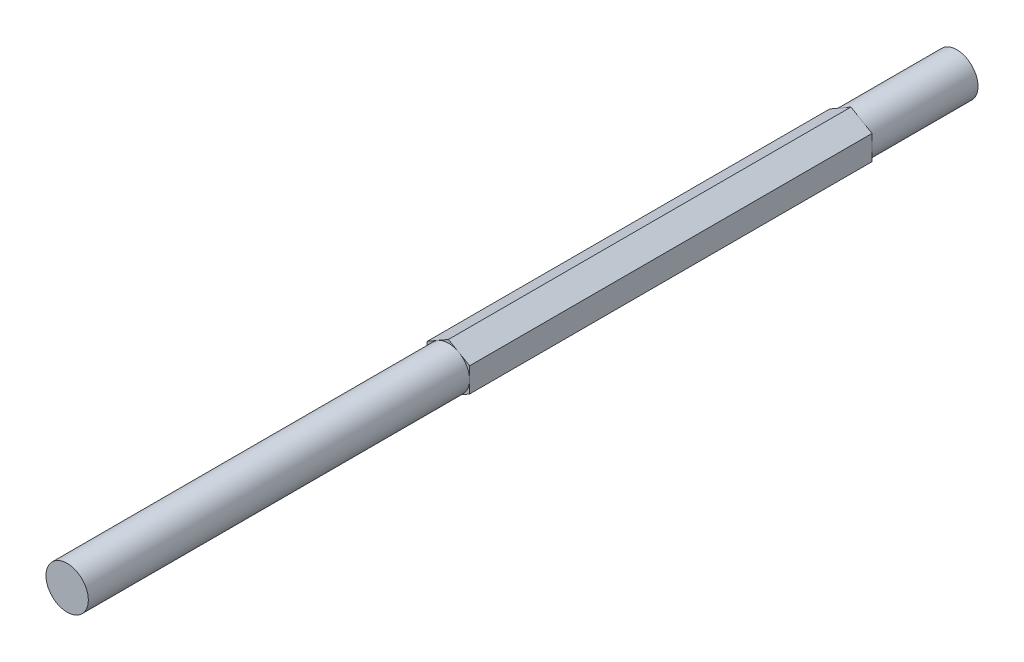
ISO-10303-21;
HEADER;
FILE_DESCRIPTION(('STEP AP214'),'2;1');
FILE_NAME('part.step','',(''),(''),'','','');
FILE_SCHEMA(('AUTOMOTIVE_DESIGN { 1 0 10303 214 1 1 1 1 }'));
ENDSEC;
DATA;
#1=APPLICATION_CONTEXT('core data for automotive mechanical design processes');
#2=APPLICATION_PROTOCOL_DEFINITION('international standard','automotive_design',2000,#1);
#3=PRODUCT_CONTEXT('',#1,'mechanical');
#4=PRODUCT('Part','Part','',(#3));
#5=PRODUCT_RELATED_PRODUCT_CATEGORY('part','',(#4));
#6=PRODUCT_DEFINITION_FORMATION('','',#4);
#7=PRODUCT_DEFINITION_CONTEXT('part definition',#1,'design');
#8=PRODUCT_DEFINITION('design','',#6,#7);
#9=PRODUCT_DEFINITION_SHAPE('','',#8);
#10=(LENGTH_UNIT() NAMED_UNIT(*) SI_UNIT(.MILLI.,.METRE.));
#11=(NAMED_UNIT(*) PLANE_ANGLE_UNIT() SI_UNIT($,.RADIAN.));
#12=(NAMED_UNIT(*) SI_UNIT($,.STERADIAN.) SOLID_ANGLE_UNIT());
#13=UNCERTAINTY_MEASURE_WITH_UNIT(LENGTH_MEASURE(1.E-05),#10,'distance_accuracy_value','');
#14=(GEOMETRIC_REPRESENTATION_CONTEXT(3) GLOBAL_UNCERTAINTY_ASSIGNED_CONTEXT((#13)) GLOBAL_UNIT_ASSIGNED_CONTEXT((#10,
#11,#12)) REPRESENTATION_CONTEXT('',''));
#15=CARTESIAN_POINT('',(0.,0.,0.));
#16=DIRECTION('',(0.,0.,1.));
#17=DIRECTION('',(1.,0.,0.));
#18=AXIS2_PLACEMENT_3D('',#15,#16,#17);
#19=CARTESIAN_POINT('',(3.17499999999998,1.83308710467707,133.35));
#20=DIRECTION('',(-0.5,-0.866025403784439,0.));
#21=DIRECTION('',(0.866025403784439,-0.5,0.));
#22=AXIS2_PLACEMENT_3D('',#19,#20,#21);
#23=PLANE('',#22);
#24=DIRECTION('',(0.866025403784439,-0.5,0.));
#25=VECTOR('',#24,1.);
#26=CARTESIAN_POINT('',(3.17499999999998,1.83308710467707,15.875));
#27=LINE('',#26,#25);
#28=CARTESIAN_POINT('',(0.,3.66617420935412,15.875));
#29=VERTEX_POINT('',#28);
#30=CARTESIAN_POINT('',(1.5875,2.74963065701559,15.875));
#31=VERTEX_POINT('',#30);
#32=EDGE_CURVE('E265',#29,#31,#27,.T.);
#33=ORIENTED_EDGE('',*,*,#32,.F.);
#34=DIRECTION('',(0.,0.,-1.));
#35=VECTOR('',#34,1.);
#36=CARTESIAN_POINT('',(0.,3.66617420935412,133.35));
#37=LINE('',#36,#35);
#38=CARTESIAN_POINT('',(0.,3.66617420935412,76.2));
#39=VERTEX_POINT('',#38);
#40=EDGE_CURVE('E192',#39,#29,#37,.T.);
#41=ORIENTED_EDGE('',*,*,#40,.F.);
#42=DIRECTION('',(-0.866025403784439,0.5,0.));
#43=VECTOR('',#42,1.);
#44=CARTESIAN_POINT('',(3.17499999999998,1.83308710467707,76.2));
#45=LINE('',#44,#43);
#46=CARTESIAN_POINT('',(1.58749999999999,2.74963065701558,76.2));
#47=VERTEX_POINT('',#46);
#48=EDGE_CURVE('E177',#47,#39,#45,.T.);
#49=ORIENTED_EDGE('',*,*,#48,.F.);
#50=CARTESIAN_POINT('',(3.17499999999998,1.83308710467707,76.2));
#51=VERTEX_POINT('',#50);
#52=EDGE_CURVE('E179',#51,#47,#45,.T.);
#53=ORIENTED_EDGE('',*,*,#52,.F.);
#54=DIRECTION('',(0.,0.,-1.));
#55=VECTOR('',#54,1.);
#56=CARTESIAN_POINT('',(3.17499999999998,1.83308710467707,133.35));
#57=LINE('',#56,#55);
#58=CARTESIAN_POINT('',(3.17499999999998,1.83308710467707,15.875));
#59=VERTEX_POINT('',#58);
#60=EDGE_CURVE('E180',#51,#59,#57,.T.);
#61=ORIENTED_EDGE('',*,*,#60,.T.);
#62=EDGE_CURVE('E264',#31,#59,#27,.T.);
#63=ORIENTED_EDGE('',*,*,#62,.F.);
#64=EDGE_LOOP('',(#33,#41,#49,#53,#61,#63));
#65=FACE_BOUND('',#64,.T.);
#66=ADVANCED_FACE('F34',(#65),#23,.F.);
#67=CARTESIAN_POINT('',(0.,3.66617420935412,133.35));
#68=DIRECTION('',(0.499999999999999,-0.866025403784439,0.));
#69=DIRECTION('',(0.866025403784439,0.499999999999999,0.));
#70=AXIS2_PLACEMENT_3D('',#67,#68,#69);
#71=PLANE('',#70);
#72=DIRECTION('',(0.866025403784439,0.499999999999999,0.));
#73=VECTOR('',#72,1.);
#74=CARTESIAN_POINT('',(0.,3.66617420935412,15.875));
#75=LINE('',#74,#73);
#76=CARTESIAN_POINT('',(-3.17500000000001,1.83308710467706,15.875));
#77=VERTEX_POINT('',#76);
#78=CARTESIAN_POINT('',(-1.5875,2.74963065701559,15.875));
#79=VERTEX_POINT('',#78);
#80=EDGE_CURVE('E149',#77,#79,#75,.T.);
#81=ORIENTED_EDGE('',*,*,#80,.F.);
#82=DIRECTION('',(0.,0.,-1.));
#83=VECTOR('',#82,1.);
#84=CARTESIAN_POINT('',(-3.17500000000001,1.83308710467706,133.35));
#85=LINE('',#84,#83);
#86=CARTESIAN_POINT('',(-3.17500000000001,1.83308710467706,76.2));
#87=VERTEX_POINT('',#86);
#88=EDGE_CURVE('E157',#87,#77,#85,.T.);
#89=ORIENTED_EDGE('',*,*,#88,.F.);
#90=DIRECTION('',(-0.866025403784439,-0.499999999999999,0.));
#91=VECTOR('',#90,1.);
#92=CARTESIAN_POINT('',(0.,3.66617420935412,76.2));
#93=LINE('',#92,#91);
#94=CARTESIAN_POINT('',(-1.58749999999999,2.74963065701558,76.2));
#95=VERTEX_POINT('',#94);
#96=EDGE_CURVE('E174',#95,#87,#93,.T.);
#97=ORIENTED_EDGE('',*,*,#96,.F.);
#98=EDGE_CURVE('E176',#39,#95,#93,.T.);
#99=ORIENTED_EDGE('',*,*,#98,.F.);
#100=ORIENTED_EDGE('',*,*,#40,.T.);
#101=EDGE_CURVE('E162',#79,#29,#75,.T.);
#102=ORIENTED_EDGE('',*,*,#101,.F.);
#103=EDGE_LOOP('',(#81,#89,#97,#99,#100,#102));
#104=FACE_BOUND('',#103,.T.);
#105=ADVANCED_FACE('F232',(#104),#71,.F.);
#106=CARTESIAN_POINT('',(-3.17500000000001,1.83308710467706,133.35));
#107=DIRECTION('',(1.,0.,0.));
#108=DIRECTION('',(0.,0.,-1.));
#109=AXIS2_PLACEMENT_3D('',#106,#107,#108);
#110=PLANE('',#109);
#111=DIRECTION('',(0.,1.,0.));
#112=VECTOR('',#111,1.);
#113=CARTESIAN_POINT('',(-3.17500000000001,1.83308710467706,15.875));
#114=LINE('',#113,#112);
#115=CARTESIAN_POINT('',(-3.17500000000001,-1.83308710467706,15.875));
#116=VERTEX_POINT('',#115);
#117=CARTESIAN_POINT('',(-3.175,0.,15.875));
#118=VERTEX_POINT('',#117);
#119=EDGE_CURVE('E124',#116,#118,#114,.T.);
#120=ORIENTED_EDGE('',*,*,#119,.F.);
#121=DIRECTION('',(0.,0.,-1.));
#122=VECTOR('',#121,1.);
#123=CARTESIAN_POINT('',(-3.17500000000001,-1.83308710467706,133.35));
#124=LINE('',#123,#122);
#125=CARTESIAN_POINT('',(-3.17500000000001,-1.83308710467706,76.2));
#126=VERTEX_POINT('',#125);
#127=EDGE_CURVE('E189',#126,#116,#124,.T.);
#128=ORIENTED_EDGE('',*,*,#127,.F.);
#129=DIRECTION('',(0.,-1.,0.));
#130=VECTOR('',#129,1.);
#131=CARTESIAN_POINT('',(-3.17500000000001,1.83308710467706,76.2));
#132=LINE('',#131,#130);
#133=CARTESIAN_POINT('',(-3.17499999999998,0.,76.2));
#134=VERTEX_POINT('',#133);
#135=EDGE_CURVE('E171',#134,#126,#132,.T.);
#136=ORIENTED_EDGE('',*,*,#135,.F.);
#137=EDGE_CURVE('E173',#87,#134,#132,.T.);
#138=ORIENTED_EDGE('',*,*,#137,.F.);
#139=ORIENTED_EDGE('',*,*,#88,.T.);
#140=EDGE_CURVE('E136',#118,#77,#114,.T.);
#141=ORIENTED_EDGE('',*,*,#140,.F.);
#142=EDGE_LOOP('',(#120,#128,#136,#138,#139,#141));
#143=FACE_BOUND('',#142,.T.);
#144=ADVANCED_FACE('F154',(#143),#110,.F.);
#145=CARTESIAN_POINT('',(-3.17500000000001,-1.83308710467706,133.35));
#146=DIRECTION('',(0.500000000000001,0.866025403784438,0.));
#147=DIRECTION('',(-0.866025403784438,0.500000000000001,0.));
#148=AXIS2_PLACEMENT_3D('',#145,#146,#147);
#149=PLANE('',#148);
#150=DIRECTION('',(-0.866025403784438,0.500000000000001,0.));
#151=VECTOR('',#150,1.);
#152=CARTESIAN_POINT('',(-3.17500000000001,-1.83308710467706,15.875));
#153=LINE('',#152,#151);
#154=CARTESIAN_POINT('',(0.,-3.66617420935412,15.875));
#155=VERTEX_POINT('',#154);
#156=CARTESIAN_POINT('',(-1.5875,-2.74963065701559,15.875));
#157=VERTEX_POINT('',#156);
#158=EDGE_CURVE('E159',#155,#157,#153,.T.);
#159=ORIENTED_EDGE('',*,*,#158,.F.);
#160=DIRECTION('',(0.,0.,-1.));
#161=VECTOR('',#160,1.);
#162=CARTESIAN_POINT('',(0.,-3.66617420935412,133.35));
#163=LINE('',#162,#161);
#164=CARTESIAN_POINT('',(0.,-3.66617420935412,76.2));
#165=VERTEX_POINT('',#164);
#166=EDGE_CURVE('E186',#165,#155,#163,.T.);
#167=ORIENTED_EDGE('',*,*,#166,.F.);
#168=DIRECTION('',(0.866025403784438,-0.500000000000001,0.));
#169=VECTOR('',#168,1.);
#170=CARTESIAN_POINT('',(-3.17500000000001,-1.83308710467706,76.2));
#171=LINE('',#170,#169);
#172=CARTESIAN_POINT('',(-1.58749999999999,-2.74963065701558,76.2));
#173=VERTEX_POINT('',#172);
#174=EDGE_CURVE('E168',#173,#165,#171,.T.);
#175=ORIENTED_EDGE('',*,*,#174,.F.);
#176=EDGE_CURVE('E170',#126,#173,#171,.T.);
#177=ORIENTED_EDGE('',*,*,#176,.F.);
#178=ORIENTED_EDGE('',*,*,#127,.T.);
#179=EDGE_CURVE('E130',#157,#116,#153,.T.);
#180=ORIENTED_EDGE('',*,*,#179,.F.);
#181=EDGE_LOOP('',(#159,#167,#175,#177,#178,#180));
#182=FACE_BOUND('',#181,.T.);
#183=ADVANCED_FACE('F248',(#182),#149,.F.);
#184=CARTESIAN_POINT('',(0.,-3.66617420935412,133.35));
#185=DIRECTION('',(-0.5,0.866025403784439,0.));
#186=DIRECTION('',(-0.866025403784439,-0.5,0.));
#187=AXIS2_PLACEMENT_3D('',#184,#185,#186);
#188=PLANE('',#187);
#189=DIRECTION('',(-0.866025403784439,-0.5,0.));
#190=VECTOR('',#189,1.);
#191=CARTESIAN_POINT('',(0.,-3.66617420935412,15.875));
#192=LINE('',#191,#190);
#193=CARTESIAN_POINT('',(3.17499999999998,-1.83308710467706,15.875));
#194=VERTEX_POINT('',#193);
#195=CARTESIAN_POINT('',(1.5875,-2.74963065701559,15.875));
#196=VERTEX_POINT('',#195);
#197=EDGE_CURVE('E151',#194,#196,#192,.T.);
#198=ORIENTED_EDGE('',*,*,#197,.F.);
#199=DIRECTION('',(0.,0.,-1.));
#200=VECTOR('',#199,1.);
#201=CARTESIAN_POINT('',(3.17499999999998,-1.83308710467706,133.35));
#202=LINE('',#201,#200);
#203=CARTESIAN_POINT('',(3.17499999999998,-1.83308710467706,76.2));
#204=VERTEX_POINT('',#203);
#205=EDGE_CURVE('E183',#204,#194,#202,.T.);
#206=ORIENTED_EDGE('',*,*,#205,.F.);
#207=DIRECTION('',(0.866025403784439,0.5,0.));
#208=VECTOR('',#207,1.);
#209=CARTESIAN_POINT('',(0.,-3.66617420935412,76.2));
#210=LINE('',#209,#208);
#211=CARTESIAN_POINT('',(1.58749999999999,-2.74963065701558,76.2));
#212=VERTEX_POINT('',#211);
#213=EDGE_CURVE('E164',#212,#204,#210,.T.);
#214=ORIENTED_EDGE('',*,*,#213,.F.);
#215=EDGE_CURVE('E167',#165,#212,#210,.T.);
#216=ORIENTED_EDGE('',*,*,#215,.F.);
#217=ORIENTED_EDGE('',*,*,#166,.T.);
#218=EDGE_CURVE('E267',#196,#155,#192,.T.);
#219=ORIENTED_EDGE('',*,*,#218,.F.);
#220=EDGE_LOOP('',(#198,#206,#214,#216,#217,#219));
#221=FACE_BOUND('',#220,.T.);
#222=ADVANCED_FACE('F256',(#221),#188,.F.);
#223=CARTESIAN_POINT('',(3.17499999999998,-1.83308710467706,133.35));
#224=DIRECTION('',(-1.,0.,0.));
#225=DIRECTION('',(0.,0.,1.));
#226=AXIS2_PLACEMENT_3D('',#223,#224,#225);
#227=PLANE('',#226);
#228=DIRECTION('',(0.,-1.,0.));
#229=VECTOR('',#228,1.);
#230=CARTESIAN_POINT('',(3.17499999999998,-1.83308710467706,15.875));
#231=LINE('',#230,#229);
#232=CARTESIAN_POINT('',(3.17499999999999,0.,15.875));
#233=VERTEX_POINT('',#232);
#234=EDGE_CURVE('E12',#59,#233,#231,.T.);
#235=ORIENTED_EDGE('',*,*,#234,.F.);
#236=ORIENTED_EDGE('',*,*,#60,.F.);
#237=DIRECTION('',(0.,1.,0.));
#238=VECTOR('',#237,1.);
#239=CARTESIAN_POINT('',(3.17499999999998,-1.83308710467706,76.2));
#240=LINE('',#239,#238);
#241=CARTESIAN_POINT('',(3.17499999999998,0.,76.2));
#242=VERTEX_POINT('',#241);
#243=EDGE_CURVE('E198',#242,#51,#240,.T.);
#244=ORIENTED_EDGE('',*,*,#243,.F.);
#245=EDGE_CURVE('E199',#204,#242,#240,.T.);
#246=ORIENTED_EDGE('',*,*,#245,.F.);
#247=ORIENTED_EDGE('',*,*,#205,.T.);
#248=EDGE_CURVE('E37',#233,#194,#231,.T.);
#249=ORIENTED_EDGE('',*,*,#248,.F.);
#250=EDGE_LOOP('',(#235,#236,#244,#246,#247,#249));
#251=FACE_BOUND('',#250,.T.);
#252=ADVANCED_FACE('F216',(#251),#227,.F.);
#253=CARTESIAN_POINT('',(0.,0.,76.2));
#254=DIRECTION('',(0.,0.,1.));
#255=DIRECTION('',(1.,0.,0.));
#256=AXIS2_PLACEMENT_3D('',#253,#254,#255);
#257=PLANE('',#256);
#258=ORIENTED_EDGE('',*,*,#52,.T.);
#259=CARTESIAN_POINT('',(0.,0.,76.2));
#260=DIRECTION('',(0.,0.,1.));
#261=DIRECTION('',(1.,0.,0.));
#262=AXIS2_PLACEMENT_3D('',#259,#260,#261);
#263=CIRCLE('',#262,3.17499999999998);
#264=EDGE_CURVE('E56',#242,#47,#263,.T.);
#265=ORIENTED_EDGE('',*,*,#264,.F.);
#266=ORIENTED_EDGE('',*,*,#243,.T.);
#267=EDGE_LOOP('',(#258,#265,#266));
#268=FACE_BOUND('',#267,.T.);
#269=ADVANCED_FACE('F218',(#268),#257,.T.);
#270=ORIENTED_EDGE('',*,*,#48,.T.);
#271=ORIENTED_EDGE('',*,*,#98,.T.);
#272=EDGE_CURVE('E165',#47,#95,#263,.T.);
#273=ORIENTED_EDGE('',*,*,#272,.F.);
#274=EDGE_LOOP('',(#270,#271,#273));
#275=FACE_BOUND('',#274,.T.);
#276=ADVANCED_FACE('F227',(#275),#257,.T.);
#277=ORIENTED_EDGE('',*,*,#96,.T.);
#278=ORIENTED_EDGE('',*,*,#137,.T.);
#279=EDGE_CURVE('E237',#95,#134,#263,.T.);
#280=ORIENTED_EDGE('',*,*,#279,.F.);
#281=EDGE_LOOP('',(#277,#278,#280));
#282=FACE_BOUND('',#281,.T.);
#283=ADVANCED_FACE('F234',(#282),#257,.T.);
#284=ORIENTED_EDGE('',*,*,#135,.T.);
#285=ORIENTED_EDGE('',*,*,#176,.T.);
#286=EDGE_CURVE('E244',#134,#173,#263,.T.);
#287=ORIENTED_EDGE('',*,*,#286,.F.);
#288=EDGE_LOOP('',(#284,#285,#287));
#289=FACE_BOUND('',#288,.T.);
#290=ADVANCED_FACE('F241',(#289),#257,.T.);
#291=ORIENTED_EDGE('',*,*,#174,.T.);
#292=ORIENTED_EDGE('',*,*,#215,.T.);
#293=EDGE_CURVE('E253',#173,#212,#263,.T.);
#294=ORIENTED_EDGE('',*,*,#293,.F.);
#295=EDGE_LOOP('',(#291,#292,#294));
#296=FACE_BOUND('',#295,.T.);
#297=ADVANCED_FACE('F252',(#296),#257,.T.);
#298=ORIENTED_EDGE('',*,*,#213,.T.);
#299=ORIENTED_EDGE('',*,*,#245,.T.);
#300=EDGE_CURVE('E135',#212,#242,#263,.T.);
#301=ORIENTED_EDGE('',*,*,#300,.F.);
#302=EDGE_LOOP('',(#298,#299,#301));
#303=FACE_BOUND('',#302,.T.);
#304=ADVANCED_FACE('F209',(#303),#257,.T.);
#305=CARTESIAN_POINT('',(0.,0.,76.2));
#306=DIRECTION('',(0.,0.,1.));
#307=DIRECTION('',(1.,0.,0.));
#308=AXIS2_PLACEMENT_3D('',#305,#306,#307);
#309=CYLINDRICAL_SURFACE('',#308,3.17499999999998);
#310=CARTESIAN_POINT('',(0.,0.,133.35));
#311=DIRECTION('',(0.,0.,1.));
#312=DIRECTION('',(1.,0.,0.));
#313=AXIS2_PLACEMENT_3D('',#310,#311,#312);
#314=CIRCLE('',#313,3.17499999999998);
#315=CARTESIAN_POINT('',(3.17499999999998,0.,133.35));
#316=VERTEX_POINT('',#315);
#317=EDGE_CURVE('E195',#316,#316,#314,.T.);
#318=ORIENTED_EDGE('',*,*,#317,.F.);
#319=EDGE_LOOP('',(#318));
#320=FACE_BOUND('',#319,.T.);
#321=ORIENTED_EDGE('',*,*,#264,.T.);
#322=ORIENTED_EDGE('',*,*,#272,.T.);
#323=ORIENTED_EDGE('',*,*,#279,.T.);
#324=ORIENTED_EDGE('',*,*,#286,.T.);
#325=ORIENTED_EDGE('',*,*,#293,.T.);
#326=ORIENTED_EDGE('',*,*,#300,.T.);
#327=EDGE_LOOP('',(#321,#322,#323,#324,#325,#326));
#328=FACE_BOUND('',#327,.T.);
#329=ADVANCED_FACE('F303',(#320,#328),#309,.T.);
#330=CARTESIAN_POINT('',(0.,0.,133.35));
#331=DIRECTION('',(0.,0.,1.));
#332=DIRECTION('',(1.,0.,0.));
#333=AXIS2_PLACEMENT_3D('',#330,#331,#332);
#334=PLANE('',#333);
#335=ORIENTED_EDGE('',*,*,#317,.T.);
#336=EDGE_LOOP('',(#335));
#337=FACE_BOUND('',#336,.T.);
#338=ADVANCED_FACE('F300',(#337),#334,.T.);
#339=CARTESIAN_POINT('',(0.,0.,15.875));
#340=DIRECTION('',(0.,0.,-1.));
#341=DIRECTION('',(-1.,0.,0.));
#342=AXIS2_PLACEMENT_3D('',#339,#340,#341);
#343=PLANE('',#342);
#344=ORIENTED_EDGE('',*,*,#119,.T.);
#345=CARTESIAN_POINT('',(0.,0.,15.875));
#346=DIRECTION('',(0.,0.,-1.));
#347=DIRECTION('',(-1.,0.,0.));
#348=AXIS2_PLACEMENT_3D('',#345,#346,#347);
#349=CIRCLE('',#348,3.175);
#350=EDGE_CURVE('E127',#157,#118,#349,.T.);
#351=ORIENTED_EDGE('',*,*,#350,.F.);
#352=ORIENTED_EDGE('',*,*,#179,.T.);
#353=EDGE_LOOP('',(#344,#351,#352));
#354=FACE_BOUND('',#353,.T.);
#355=ADVANCED_FACE('F126',(#354),#343,.T.);
#356=ORIENTED_EDGE('',*,*,#140,.T.);
#357=ORIENTED_EDGE('',*,*,#80,.T.);
#358=EDGE_CURVE('E141',#118,#79,#349,.T.);
#359=ORIENTED_EDGE('',*,*,#358,.F.);
#360=EDGE_LOOP('',(#356,#357,#359));
#361=FACE_BOUND('',#360,.T.);
#362=ADVANCED_FACE('F147',(#361),#343,.T.);
#363=ORIENTED_EDGE('',*,*,#101,.T.);
#364=ORIENTED_EDGE('',*,*,#32,.T.);
#365=EDGE_CURVE('E152',#79,#31,#349,.T.);
#366=ORIENTED_EDGE('',*,*,#365,.F.);
#367=EDGE_LOOP('',(#363,#364,#366));
#368=FACE_BOUND('',#367,.T.);
#369=ADVANCED_FACE('F272',(#368),#343,.T.);
#370=ORIENTED_EDGE('',*,*,#158,.T.);
#371=EDGE_CURVE('E144',#196,#157,#349,.T.);
#372=ORIENTED_EDGE('',*,*,#371,.F.);
#373=ORIENTED_EDGE('',*,*,#218,.T.);
#374=EDGE_LOOP('',(#370,#372,#373));
#375=FACE_BOUND('',#374,.T.);
#376=ADVANCED_FACE('F270',(#375),#343,.T.);
#377=ORIENTED_EDGE('',*,*,#62,.T.);
#378=ORIENTED_EDGE('',*,*,#234,.T.);
#379=EDGE_CURVE('E48',#31,#233,#349,.T.);
#380=ORIENTED_EDGE('',*,*,#379,.F.);
#381=EDGE_LOOP('',(#377,#378,#380));
#382=FACE_BOUND('',#381,.T.);
#383=ADVANCED_FACE('F263',(#382),#343,.T.);
#384=ORIENTED_EDGE('',*,*,#197,.T.);
#385=EDGE_CURVE('E261',#233,#196,#349,.T.);
#386=ORIENTED_EDGE('',*,*,#385,.F.);
#387=ORIENTED_EDGE('',*,*,#248,.T.);
#388=EDGE_LOOP('',(#384,#386,#387));
#389=FACE_BOUND('',#388,.T.);
#390=ADVANCED_FACE('F260',(#389),#343,.T.);
#391=CARTESIAN_POINT('',(0.,0.,15.875));
#392=DIRECTION('',(0.,0.,-1.));
#393=DIRECTION('',(-1.,0.,0.));
#394=AXIS2_PLACEMENT_3D('',#391,#392,#393);
#395=CYLINDRICAL_SURFACE('',#394,3.175);
#396=CARTESIAN_POINT('',(0.,0.,0.));
#397=DIRECTION('',(0.,0.,1.));
#398=DIRECTION('',(1.,0.,0.));
#399=AXIS2_PLACEMENT_3D('',#396,#397,#398);
#400=CIRCLE('',#399,3.175);
#401=CARTESIAN_POINT('',(3.175,0.,0.));
#402=VERTEX_POINT('',#401);
#403=EDGE_CURVE('E200',#402,#402,#400,.T.);
#404=ORIENTED_EDGE('',*,*,#403,.T.);
#405=EDGE_LOOP('',(#404));
#406=FACE_BOUND('',#405,.T.);
#407=ORIENTED_EDGE('',*,*,#365,.T.);
#408=ORIENTED_EDGE('',*,*,#379,.T.);
#409=ORIENTED_EDGE('',*,*,#385,.T.);
#410=ORIENTED_EDGE('',*,*,#371,.T.);
#411=ORIENTED_EDGE('',*,*,#350,.T.);
#412=ORIENTED_EDGE('',*,*,#358,.T.);
#413=EDGE_LOOP('',(#407,#408,#409,#410,#411,#412));
#414=FACE_BOUND('',#413,.T.);
#415=ADVANCED_FACE('F140',(#406,#414),#395,.T.);
#416=CARTESIAN_POINT('',(0.,0.,0.));
#417=DIRECTION('',(0.,0.,1.));
#418=DIRECTION('',(1.,0.,0.));
#419=AXIS2_PLACEMENT_3D('',#416,#417,#418);
#420=PLANE('',#419);
#421=ORIENTED_EDGE('',*,*,#403,.F.);
#422=EDGE_LOOP('',(#421));
#423=FACE_BOUND('',#422,.T.);
#424=ADVANCED_FACE('F296',(#423),#420,.F.);
#425=CLOSED_SHELL('',(#66,#105,#144,#183,#222,#252,#269,#276,#283,#290,#297,#304,#329,#338,#355,
#362,#369,#376,#383,#390,#415,#424));
#426=MANIFOLD_SOLID_BREP('B2',#425);
#427=ADVANCED_BREP_SHAPE_REPRESENTATION('',(#18,#426),#14);
#428=SHAPE_DEFINITION_REPRESENTATION(#9,#427);
ENDSEC;
END-ISO-10303-21;
